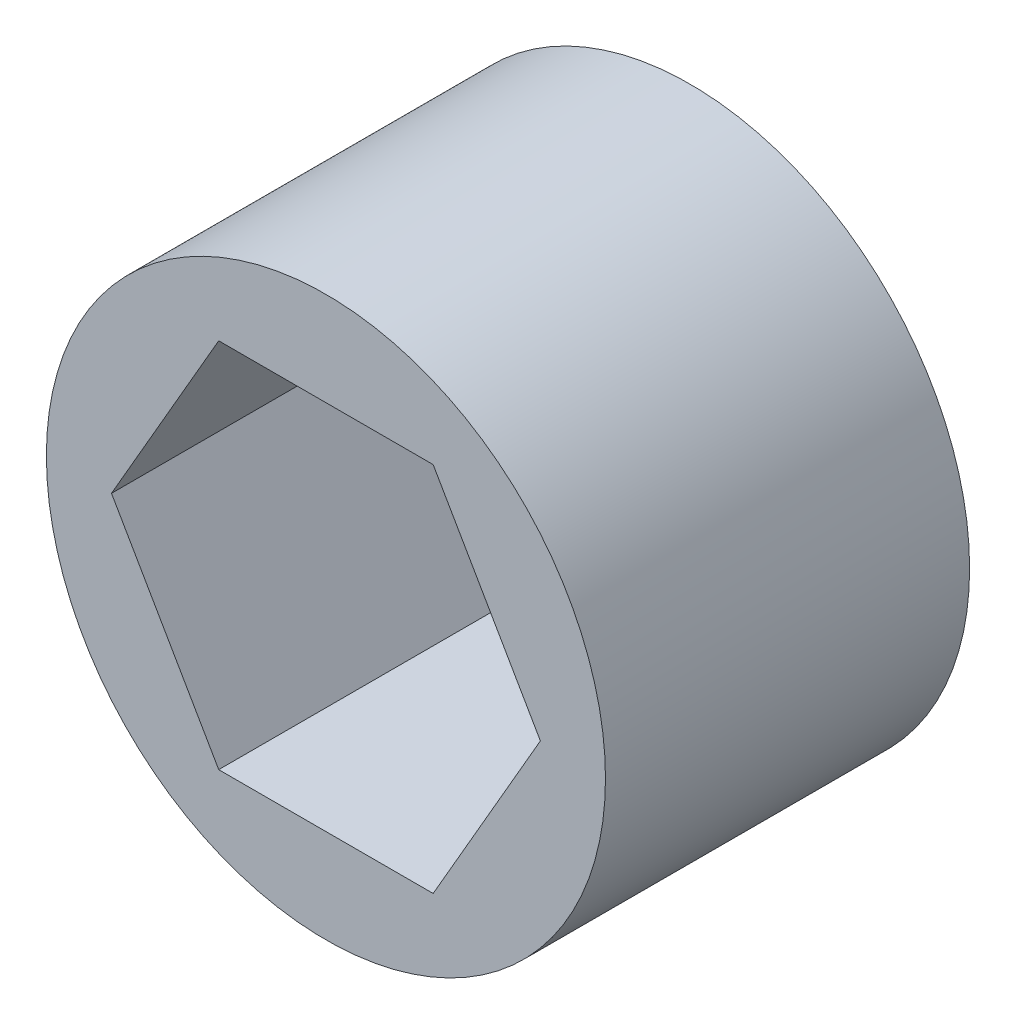
ISO-10303-21;
HEADER;
FILE_DESCRIPTION(('STEP AP214'),'2;1');
FILE_NAME('part.step','',(''),(''),'','','');
FILE_SCHEMA(('AUTOMOTIVE_DESIGN { 1 0 10303 214 1 1 1 1 }'));
ENDSEC;
DATA;
#1=APPLICATION_CONTEXT('core data for automotive mechanical design processes');
#2=APPLICATION_PROTOCOL_DEFINITION('international standard','automotive_design',2000,#1);
#3=PRODUCT_CONTEXT('',#1,'mechanical');
#4=PRODUCT('Part','Part','',(#3));
#5=PRODUCT_RELATED_PRODUCT_CATEGORY('part','',(#4));
#6=PRODUCT_DEFINITION_FORMATION('','',#4);
#7=PRODUCT_DEFINITION_CONTEXT('part definition',#1,'design');
#8=PRODUCT_DEFINITION('design','',#6,#7);
#9=PRODUCT_DEFINITION_SHAPE('','',#8);
#10=(LENGTH_UNIT() NAMED_UNIT(*) SI_UNIT(.MILLI.,.METRE.));
#11=(NAMED_UNIT(*) PLANE_ANGLE_UNIT() SI_UNIT($,.RADIAN.));
#12=(NAMED_UNIT(*) SI_UNIT($,.STERADIAN.) SOLID_ANGLE_UNIT());
#13=UNCERTAINTY_MEASURE_WITH_UNIT(LENGTH_MEASURE(1.E-05),#10,'distance_accuracy_value','');
#14=(GEOMETRIC_REPRESENTATION_CONTEXT(3) GLOBAL_UNCERTAINTY_ASSIGNED_CONTEXT((#13)) GLOBAL_UNIT_ASSIGNED_CONTEXT((#10,
#11,#12)) REPRESENTATION_CONTEXT('',''));
#15=CARTESIAN_POINT('',(0.,0.,0.));
#16=DIRECTION('',(0.,0.,1.));
#17=DIRECTION('',(1.,0.,0.));
#18=AXIS2_PLACEMENT_3D('',#15,#16,#17);
#19=CARTESIAN_POINT('',(-7.47899538708241,0.,6.35));
#20=DIRECTION('',(0.866025403784439,0.5,0.));
#21=DIRECTION('',(-0.5,0.866025403784439,0.));
#22=AXIS2_PLACEMENT_3D('',#19,#20,#21);
#23=PLANE('',#22);
#24=DIRECTION('',(-0.5,0.866025403784438,0.));
#25=VECTOR('',#24,1.);
#26=CARTESIAN_POINT('',(-3.73949769354121,-6.477,6.35));
#27=LINE('',#26,#25);
#28=CARTESIAN_POINT('',(-3.73949769354121,-6.477,6.35));
#29=VERTEX_POINT('',#28);
#30=CARTESIAN_POINT('',(-7.47899538708241,0.,6.35));
#31=VERTEX_POINT('',#30);
#32=EDGE_CURVE('E85',#29,#31,#27,.T.);
#33=ORIENTED_EDGE('',*,*,#32,.F.);
#34=DIRECTION('',(0.,0.,1.));
#35=VECTOR('',#34,1.);
#36=CARTESIAN_POINT('',(-3.73949769354121,-6.477,6.35));
#37=LINE('',#36,#35);
#38=CARTESIAN_POINT('',(-3.73949769354121,-6.477,-6.35));
#39=VERTEX_POINT('',#38);
#40=EDGE_CURVE('E77',#39,#29,#37,.T.);
#41=ORIENTED_EDGE('',*,*,#40,.F.);
#42=DIRECTION('',(-0.5,0.866025403784439,0.));
#43=VECTOR('',#42,1.);
#44=CARTESIAN_POINT('',(-3.73949769354121,-6.477,-6.35));
#45=LINE('',#44,#43);
#46=CARTESIAN_POINT('',(-7.47899538708241,0.,-6.35));
#47=VERTEX_POINT('',#46);
#48=EDGE_CURVE('E117',#39,#47,#45,.T.);
#49=ORIENTED_EDGE('',*,*,#48,.T.);
#50=DIRECTION('',(0.,0.,1.));
#51=VECTOR('',#50,1.);
#52=CARTESIAN_POINT('',(-7.47899538708241,0.,6.35));
#53=LINE('',#52,#51);
#54=EDGE_CURVE('E102',#31,#47,#53,.F.);
#55=ORIENTED_EDGE('',*,*,#54,.F.);
#56=EDGE_LOOP('',(#33,#41,#49,#55));
#57=FACE_BOUND('',#56,.T.);
#58=ADVANCED_FACE('F18',(#57),#23,.T.);
#59=CARTESIAN_POINT('',(-3.73949769354121,6.477,6.35));
#60=DIRECTION('',(0.866025403784439,-0.5,0.));
#61=DIRECTION('',(0.5,0.866025403784439,0.));
#62=AXIS2_PLACEMENT_3D('',#59,#60,#61);
#63=PLANE('',#62);
#64=DIRECTION('',(0.5,0.866025403784439,0.));
#65=VECTOR('',#64,1.);
#66=CARTESIAN_POINT('',(-7.47899538708242,0.,6.35));
#67=LINE('',#66,#65);
#68=CARTESIAN_POINT('',(-3.73949769354121,6.477,6.35));
#69=VERTEX_POINT('',#68);
#70=EDGE_CURVE('E110',#31,#69,#67,.T.);
#71=ORIENTED_EDGE('',*,*,#70,.F.);
#72=ORIENTED_EDGE('',*,*,#54,.T.);
#73=DIRECTION('',(0.5,0.866025403784439,0.));
#74=VECTOR('',#73,1.);
#75=CARTESIAN_POINT('',(-7.47899538708241,0.,-6.35));
#76=LINE('',#75,#74);
#77=CARTESIAN_POINT('',(-3.73949769354121,6.477,-6.35));
#78=VERTEX_POINT('',#77);
#79=EDGE_CURVE('E108',#47,#78,#76,.T.);
#80=ORIENTED_EDGE('',*,*,#79,.T.);
#81=DIRECTION('',(0.,0.,1.));
#82=VECTOR('',#81,1.);
#83=CARTESIAN_POINT('',(-3.73949769354121,6.477,6.35));
#84=LINE('',#83,#82);
#85=EDGE_CURVE('E99',#69,#78,#84,.F.);
#86=ORIENTED_EDGE('',*,*,#85,.F.);
#87=EDGE_LOOP('',(#71,#72,#80,#86));
#88=FACE_BOUND('',#87,.T.);
#89=ADVANCED_FACE('F107',(#88),#63,.T.);
#90=CARTESIAN_POINT('',(3.7394976935412,6.477,6.35));
#91=DIRECTION('',(0.,-1.,0.));
#92=DIRECTION('',(1.,0.,0.));
#93=AXIS2_PLACEMENT_3D('',#90,#91,#92);
#94=PLANE('',#93);
#95=DIRECTION('',(1.,0.,0.));
#96=VECTOR('',#95,1.);
#97=CARTESIAN_POINT('',(0.,6.477,6.35));
#98=LINE('',#97,#96);
#99=CARTESIAN_POINT('',(3.7394976935412,6.477,6.35));
#100=VERTEX_POINT('',#99);
#101=EDGE_CURVE('E127',#69,#100,#98,.T.);
#102=ORIENTED_EDGE('',*,*,#101,.F.);
#103=ORIENTED_EDGE('',*,*,#85,.T.);
#104=DIRECTION('',(1.,0.,0.));
#105=VECTOR('',#104,1.);
#106=CARTESIAN_POINT('',(0.,6.477,-6.35));
#107=LINE('',#106,#105);
#108=CARTESIAN_POINT('',(3.7394976935412,6.477,-6.35));
#109=VERTEX_POINT('',#108);
#110=EDGE_CURVE('E119',#78,#109,#107,.T.);
#111=ORIENTED_EDGE('',*,*,#110,.T.);
#112=DIRECTION('',(0.,0.,1.));
#113=VECTOR('',#112,1.);
#114=CARTESIAN_POINT('',(3.7394976935412,6.47700000000001,6.35));
#115=LINE('',#114,#113);
#116=EDGE_CURVE('E96',#100,#109,#115,.F.);
#117=ORIENTED_EDGE('',*,*,#116,.F.);
#118=EDGE_LOOP('',(#102,#103,#111,#117));
#119=FACE_BOUND('',#118,.T.);
#120=ADVANCED_FACE('F136',(#119),#94,.T.);
#121=CARTESIAN_POINT('',(7.47899538708241,0.,6.35));
#122=DIRECTION('',(-0.866025403784439,-0.5,0.));
#123=DIRECTION('',(0.5,-0.866025403784439,0.));
#124=AXIS2_PLACEMENT_3D('',#121,#122,#123);
#125=PLANE('',#124);
#126=DIRECTION('',(0.5,-0.866025403784438,0.));
#127=VECTOR('',#126,1.);
#128=CARTESIAN_POINT('',(3.7394976935412,6.477,6.35));
#129=LINE('',#128,#127);
#130=CARTESIAN_POINT('',(7.47899538708242,0.,6.35));
#131=VERTEX_POINT('',#130);
#132=EDGE_CURVE('E90',#100,#131,#129,.T.);
#133=ORIENTED_EDGE('',*,*,#132,.F.);
#134=ORIENTED_EDGE('',*,*,#116,.T.);
#135=DIRECTION('',(0.5,-0.866025403784438,0.));
#136=VECTOR('',#135,1.);
#137=CARTESIAN_POINT('',(3.7394976935412,6.477,-6.35));
#138=LINE('',#137,#136);
#139=CARTESIAN_POINT('',(7.47899538708241,0.,-6.35));
#140=VERTEX_POINT('',#139);
#141=EDGE_CURVE('E121',#109,#140,#138,.T.);
#142=ORIENTED_EDGE('',*,*,#141,.T.);
#143=DIRECTION('',(0.,0.,1.));
#144=VECTOR('',#143,1.);
#145=CARTESIAN_POINT('',(7.47899538708242,0.,6.35));
#146=LINE('',#145,#144);
#147=EDGE_CURVE('E66',#131,#140,#146,.F.);
#148=ORIENTED_EDGE('',*,*,#147,.F.);
#149=EDGE_LOOP('',(#133,#134,#142,#148));
#150=FACE_BOUND('',#149,.T.);
#151=ADVANCED_FACE('F133',(#150),#125,.T.);
#152=CARTESIAN_POINT('',(3.73949769354121,-6.477,6.35));
#153=DIRECTION('',(-0.866025403784439,0.5,0.));
#154=DIRECTION('',(-0.5,-0.866025403784439,0.));
#155=AXIS2_PLACEMENT_3D('',#152,#153,#154);
#156=PLANE('',#155);
#157=DIRECTION('',(-0.5,-0.866025403784439,0.));
#158=VECTOR('',#157,1.);
#159=CARTESIAN_POINT('',(7.47899538708241,0.,6.35));
#160=LINE('',#159,#158);
#161=CARTESIAN_POINT('',(3.73949769354121,-6.477,6.35));
#162=VERTEX_POINT('',#161);
#163=EDGE_CURVE('E72',#131,#162,#160,.T.);
#164=ORIENTED_EDGE('',*,*,#163,.F.);
#165=ORIENTED_EDGE('',*,*,#147,.T.);
#166=DIRECTION('',(-0.5,-0.866025403784439,0.));
#167=VECTOR('',#166,1.);
#168=CARTESIAN_POINT('',(7.47899538708241,0.,-6.35));
#169=LINE('',#168,#167);
#170=CARTESIAN_POINT('',(3.73949769354121,-6.477,-6.35));
#171=VERTEX_POINT('',#170);
#172=EDGE_CURVE('E34',#140,#171,#169,.T.);
#173=ORIENTED_EDGE('',*,*,#172,.T.);
#174=DIRECTION('',(0.,0.,1.));
#175=VECTOR('',#174,1.);
#176=CARTESIAN_POINT('',(3.73949769354121,-6.477,6.35));
#177=LINE('',#176,#175);
#178=EDGE_CURVE('E68',#162,#171,#177,.F.);
#179=ORIENTED_EDGE('',*,*,#178,.F.);
#180=EDGE_LOOP('',(#164,#165,#173,#179));
#181=FACE_BOUND('',#180,.T.);
#182=ADVANCED_FACE('F70',(#181),#156,.T.);
#183=CARTESIAN_POINT('',(-3.73949769354121,-6.477,6.35));
#184=DIRECTION('',(0.,1.,0.));
#185=DIRECTION('',(0.,0.,1.));
#186=AXIS2_PLACEMENT_3D('',#183,#184,#185);
#187=PLANE('',#186);
#188=DIRECTION('',(1.,0.,0.));
#189=VECTOR('',#188,1.);
#190=CARTESIAN_POINT('',(0.,-6.477,6.35));
#191=LINE('',#190,#189);
#192=EDGE_CURVE('E80',#162,#29,#191,.F.);
#193=ORIENTED_EDGE('',*,*,#192,.F.);
#194=ORIENTED_EDGE('',*,*,#178,.T.);
#195=DIRECTION('',(1.,0.,0.));
#196=VECTOR('',#195,1.);
#197=CARTESIAN_POINT('',(0.,-6.477,-6.35));
#198=LINE('',#197,#196);
#199=EDGE_CURVE('E129',#171,#39,#198,.F.);
#200=ORIENTED_EDGE('',*,*,#199,.T.);
#201=ORIENTED_EDGE('',*,*,#40,.T.);
#202=EDGE_LOOP('',(#193,#194,#200,#201));
#203=FACE_BOUND('',#202,.T.);
#204=ADVANCED_FACE('F81',(#203),#187,.T.);
#205=CARTESIAN_POINT('',(0.,0.,6.35));
#206=DIRECTION('',(0.,0.,1.));
#207=DIRECTION('',(1.,0.,0.));
#208=AXIS2_PLACEMENT_3D('',#205,#206,#207);
#209=PLANE('',#208);
#210=ORIENTED_EDGE('',*,*,#101,.T.);
#211=ORIENTED_EDGE('',*,*,#132,.T.);
#212=ORIENTED_EDGE('',*,*,#163,.T.);
#213=ORIENTED_EDGE('',*,*,#192,.T.);
#214=ORIENTED_EDGE('',*,*,#32,.T.);
#215=ORIENTED_EDGE('',*,*,#70,.T.);
#216=EDGE_LOOP('',(#210,#211,#212,#213,#214,#215));
#217=FACE_BOUND('',#216,.T.);
#218=CARTESIAN_POINT('',(0.,0.,6.35));
#219=DIRECTION('',(0.,0.,-1.));
#220=DIRECTION('',(-1.,0.,0.));
#221=AXIS2_PLACEMENT_3D('',#218,#219,#220);
#222=CIRCLE('',#221,9.75);
#223=CARTESIAN_POINT('',(-9.75,0.,6.35));
#224=VERTEX_POINT('',#223);
#225=EDGE_CURVE('E21',#224,#224,#222,.T.);
#226=ORIENTED_EDGE('',*,*,#225,.F.);
#227=EDGE_LOOP('',(#226));
#228=FACE_BOUND('',#227,.T.);
#229=ADVANCED_FACE('F88',(#217,#228),#209,.T.);
#230=CARTESIAN_POINT('',(0.,0.,-6.35));
#231=DIRECTION('',(0.,0.,1.));
#232=DIRECTION('',(1.,0.,0.));
#233=AXIS2_PLACEMENT_3D('',#230,#231,#232);
#234=PLANE('',#233);
#235=ORIENTED_EDGE('',*,*,#172,.F.);
#236=ORIENTED_EDGE('',*,*,#141,.F.);
#237=ORIENTED_EDGE('',*,*,#110,.F.);
#238=ORIENTED_EDGE('',*,*,#79,.F.);
#239=ORIENTED_EDGE('',*,*,#48,.F.);
#240=ORIENTED_EDGE('',*,*,#199,.F.);
#241=EDGE_LOOP('',(#235,#236,#237,#238,#239,#240));
#242=FACE_BOUND('',#241,.T.);
#243=CARTESIAN_POINT('',(0.,0.,-6.35));
#244=DIRECTION('',(0.,0.,-1.));
#245=DIRECTION('',(-1.,0.,0.));
#246=AXIS2_PLACEMENT_3D('',#243,#244,#245);
#247=CIRCLE('',#246,9.75);
#248=CARTESIAN_POINT('',(-9.75,0.,-6.35));
#249=VERTEX_POINT('',#248);
#250=EDGE_CURVE('E11',#249,#249,#247,.F.);
#251=ORIENTED_EDGE('',*,*,#250,.F.);
#252=EDGE_LOOP('',(#251));
#253=FACE_BOUND('',#252,.T.);
#254=ADVANCED_FACE('F115',(#242,#253),#234,.F.);
#255=CARTESIAN_POINT('',(0.,0.,6.35));
#256=DIRECTION('',(0.,0.,-1.));
#257=DIRECTION('',(-1.,0.,0.));
#258=AXIS2_PLACEMENT_3D('',#255,#256,#257);
#259=CYLINDRICAL_SURFACE('',#258,9.75);
#260=ORIENTED_EDGE('',*,*,#250,.T.);
#261=EDGE_LOOP('',(#260));
#262=FACE_BOUND('',#261,.T.);
#263=ORIENTED_EDGE('',*,*,#225,.T.);
#264=EDGE_LOOP('',(#263));
#265=FACE_BOUND('',#264,.T.);
#266=ADVANCED_FACE('F145',(#262,#265),#259,.T.);
#267=CLOSED_SHELL('',(#58,#89,#120,#151,#182,#204,#229,#254,#266));
#268=MANIFOLD_SOLID_BREP('B1',#267);
#269=ADVANCED_BREP_SHAPE_REPRESENTATION('',(#18,#268),#14);
#270=SHAPE_DEFINITION_REPRESENTATION(#9,#269);
ENDSEC;
END-ISO-10303-21;
